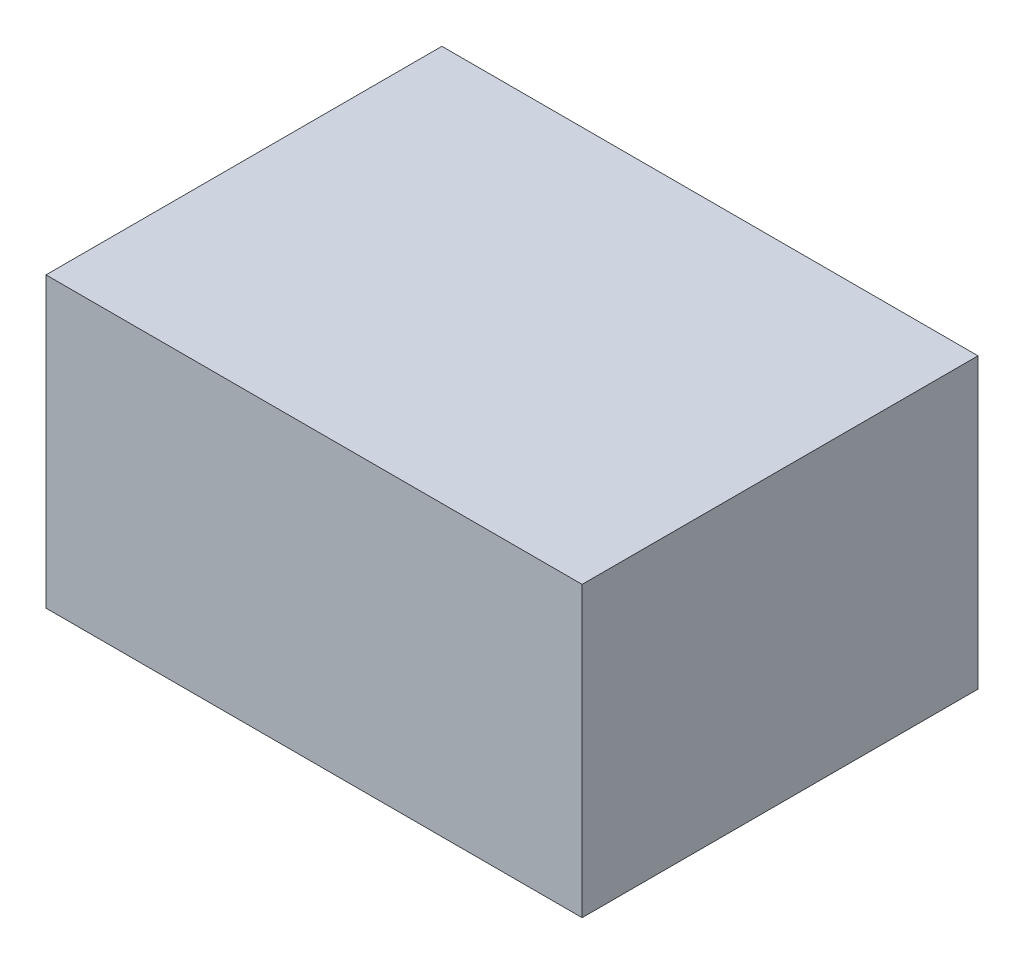
ISO-10303-21;
HEADER;
FILE_DESCRIPTION(('STEP AP214'),'2;1');
FILE_NAME('part.step','',(''),(''),'','','');
FILE_SCHEMA(('AUTOMOTIVE_DESIGN { 1 0 10303 214 1 1 1 1 }'));
ENDSEC;
DATA;
#1=APPLICATION_CONTEXT('core data for automotive mechanical design processes');
#2=APPLICATION_PROTOCOL_DEFINITION('international standard','automotive_design',2000,#1);
#3=PRODUCT_CONTEXT('',#1,'mechanical');
#4=PRODUCT('Part','Part','',(#3));
#5=PRODUCT_RELATED_PRODUCT_CATEGORY('part','',(#4));
#6=PRODUCT_DEFINITION_FORMATION('','',#4);
#7=PRODUCT_DEFINITION_CONTEXT('part definition',#1,'design');
#8=PRODUCT_DEFINITION('design','',#6,#7);
#9=PRODUCT_DEFINITION_SHAPE('','',#8);
#10=(LENGTH_UNIT() NAMED_UNIT(*) SI_UNIT(.MILLI.,.METRE.));
#11=(NAMED_UNIT(*) PLANE_ANGLE_UNIT() SI_UNIT($,.RADIAN.));
#12=(NAMED_UNIT(*) SI_UNIT($,.STERADIAN.) SOLID_ANGLE_UNIT());
#13=UNCERTAINTY_MEASURE_WITH_UNIT(LENGTH_MEASURE(1.E-05),#10,'distance_accuracy_value','');
#14=(GEOMETRIC_REPRESENTATION_CONTEXT(3) GLOBAL_UNCERTAINTY_ASSIGNED_CONTEXT((#13)) GLOBAL_UNIT_ASSIGNED_CONTEXT((#10,
#11,#12)) REPRESENTATION_CONTEXT('',''));
#15=CARTESIAN_POINT('',(0.,0.,0.));
#16=DIRECTION('',(0.,0.,1.));
#17=DIRECTION('',(1.,0.,0.));
#18=AXIS2_PLACEMENT_3D('',#15,#16,#17);
#19=CARTESIAN_POINT('',(-325.,175.,480.));
#20=DIRECTION('',(1.,0.,0.));
#21=DIRECTION('',(0.,1.,0.));
#22=AXIS2_PLACEMENT_3D('',#19,#20,#21);
#23=PLANE('',#22);
#24=DIRECTION('',(0.,-1.,0.));
#25=VECTOR('',#24,1.);
#26=CARTESIAN_POINT('',(-325.,175.,0.));
#27=LINE('',#26,#25);
#28=CARTESIAN_POINT('',(-325.,175.,0.));
#29=VERTEX_POINT('',#28);
#30=CARTESIAN_POINT('',(-325.,-175.,0.));
#31=VERTEX_POINT('',#30);
#32=EDGE_CURVE('E96',#29,#31,#27,.T.);
#33=ORIENTED_EDGE('',*,*,#32,.T.);
#34=DIRECTION('',(0.,0.,-1.));
#35=VECTOR('',#34,1.);
#36=CARTESIAN_POINT('',(-325.,-175.,480.));
#37=LINE('',#36,#35);
#38=CARTESIAN_POINT('',(-325.,-175.,480.));
#39=VERTEX_POINT('',#38);
#40=EDGE_CURVE('E11',#39,#31,#37,.T.);
#41=ORIENTED_EDGE('',*,*,#40,.F.);
#42=DIRECTION('',(0.,-1.,0.));
#43=VECTOR('',#42,1.);
#44=CARTESIAN_POINT('',(-325.,175.,480.));
#45=LINE('',#44,#43);
#46=CARTESIAN_POINT('',(-325.,175.,480.));
#47=VERTEX_POINT('',#46);
#48=EDGE_CURVE('E84',#47,#39,#45,.T.);
#49=ORIENTED_EDGE('',*,*,#48,.F.);
#50=DIRECTION('',(0.,0.,-1.));
#51=VECTOR('',#50,1.);
#52=CARTESIAN_POINT('',(-325.,175.,480.));
#53=LINE('',#52,#51);
#54=EDGE_CURVE('E92',#47,#29,#53,.T.);
#55=ORIENTED_EDGE('',*,*,#54,.T.);
#56=EDGE_LOOP('',(#33,#41,#49,#55));
#57=FACE_BOUND('',#56,.T.);
#58=ADVANCED_FACE('F33',(#57),#23,.F.);
#59=CARTESIAN_POINT('',(325.,-175.,480.));
#60=DIRECTION('',(0.,1.,0.));
#61=DIRECTION('',(-1.,0.,0.));
#62=AXIS2_PLACEMENT_3D('',#59,#60,#61);
#63=PLANE('',#62);
#64=DIRECTION('',(1.,0.,0.));
#65=VECTOR('',#64,1.);
#66=CARTESIAN_POINT('',(325.,-175.,0.));
#67=LINE('',#66,#65);
#68=CARTESIAN_POINT('',(325.,-175.,0.));
#69=VERTEX_POINT('',#68);
#70=EDGE_CURVE('E88',#31,#69,#67,.T.);
#71=ORIENTED_EDGE('',*,*,#70,.T.);
#72=DIRECTION('',(0.,0.,-1.));
#73=VECTOR('',#72,1.);
#74=CARTESIAN_POINT('',(325.,-175.,480.));
#75=LINE('',#74,#73);
#76=CARTESIAN_POINT('',(325.,-175.,480.));
#77=VERTEX_POINT('',#76);
#78=EDGE_CURVE('E41',#77,#69,#75,.T.);
#79=ORIENTED_EDGE('',*,*,#78,.F.);
#80=DIRECTION('',(1.,0.,0.));
#81=VECTOR('',#80,1.);
#82=CARTESIAN_POINT('',(325.,-175.,480.));
#83=LINE('',#82,#81);
#84=EDGE_CURVE('E79',#39,#77,#83,.T.);
#85=ORIENTED_EDGE('',*,*,#84,.F.);
#86=ORIENTED_EDGE('',*,*,#40,.T.);
#87=EDGE_LOOP('',(#71,#79,#85,#86));
#88=FACE_BOUND('',#87,.T.);
#89=ADVANCED_FACE('F87',(#88),#63,.F.);
#90=CARTESIAN_POINT('',(325.,175.,480.));
#91=DIRECTION('',(-1.,0.,0.));
#92=DIRECTION('',(0.,-1.,0.));
#93=AXIS2_PLACEMENT_3D('',#90,#91,#92);
#94=PLANE('',#93);
#95=DIRECTION('',(0.,1.,0.));
#96=VECTOR('',#95,1.);
#97=CARTESIAN_POINT('',(325.,175.,0.));
#98=LINE('',#97,#96);
#99=CARTESIAN_POINT('',(325.,175.,0.));
#100=VERTEX_POINT('',#99);
#101=EDGE_CURVE('E66',#69,#100,#98,.T.);
#102=ORIENTED_EDGE('',*,*,#101,.T.);
#103=DIRECTION('',(0.,0.,-1.));
#104=VECTOR('',#103,1.);
#105=CARTESIAN_POINT('',(325.,175.,480.));
#106=LINE('',#105,#104);
#107=CARTESIAN_POINT('',(325.,175.,480.));
#108=VERTEX_POINT('',#107);
#109=EDGE_CURVE('E89',#108,#100,#106,.T.);
#110=ORIENTED_EDGE('',*,*,#109,.F.);
#111=DIRECTION('',(0.,1.,0.));
#112=VECTOR('',#111,1.);
#113=CARTESIAN_POINT('',(325.,175.,480.));
#114=LINE('',#113,#112);
#115=EDGE_CURVE('E82',#77,#108,#114,.T.);
#116=ORIENTED_EDGE('',*,*,#115,.F.);
#117=ORIENTED_EDGE('',*,*,#78,.T.);
#118=EDGE_LOOP('',(#102,#110,#116,#117));
#119=FACE_BOUND('',#118,.T.);
#120=ADVANCED_FACE('F90',(#119),#94,.F.);
#121=CARTESIAN_POINT('',(325.,175.,480.));
#122=DIRECTION('',(0.,-1.,0.));
#123=DIRECTION('',(1.,0.,0.));
#124=AXIS2_PLACEMENT_3D('',#121,#122,#123);
#125=PLANE('',#124);
#126=DIRECTION('',(-1.,0.,0.));
#127=VECTOR('',#126,1.);
#128=CARTESIAN_POINT('',(325.,175.,0.));
#129=LINE('',#128,#127);
#130=EDGE_CURVE('E72',#100,#29,#129,.T.);
#131=ORIENTED_EDGE('',*,*,#130,.T.);
#132=ORIENTED_EDGE('',*,*,#54,.F.);
#133=DIRECTION('',(-1.,0.,0.));
#134=VECTOR('',#133,1.);
#135=CARTESIAN_POINT('',(325.,175.,480.));
#136=LINE('',#135,#134);
#137=EDGE_CURVE('E49',#108,#47,#136,.T.);
#138=ORIENTED_EDGE('',*,*,#137,.F.);
#139=ORIENTED_EDGE('',*,*,#109,.T.);
#140=EDGE_LOOP('',(#131,#132,#138,#139));
#141=FACE_BOUND('',#140,.T.);
#142=ADVANCED_FACE('F103',(#141),#125,.F.);
#143=CARTESIAN_POINT('',(0.,0.,480.));
#144=DIRECTION('',(0.,0.,-1.));
#145=DIRECTION('',(-1.,0.,0.));
#146=AXIS2_PLACEMENT_3D('',#143,#144,#145);
#147=PLANE('',#146);
#148=ORIENTED_EDGE('',*,*,#48,.T.);
#149=ORIENTED_EDGE('',*,*,#84,.T.);
#150=ORIENTED_EDGE('',*,*,#115,.T.);
#151=ORIENTED_EDGE('',*,*,#137,.T.);
#152=EDGE_LOOP('',(#148,#149,#150,#151));
#153=FACE_BOUND('',#152,.T.);
#154=ADVANCED_FACE('F80',(#153),#147,.F.);
#155=CARTESIAN_POINT('',(0.,0.,0.));
#156=DIRECTION('',(0.,0.,-1.));
#157=DIRECTION('',(-1.,0.,0.));
#158=AXIS2_PLACEMENT_3D('',#155,#156,#157);
#159=PLANE('',#158);
#160=ORIENTED_EDGE('',*,*,#32,.F.);
#161=ORIENTED_EDGE('',*,*,#130,.F.);
#162=ORIENTED_EDGE('',*,*,#101,.F.);
#163=ORIENTED_EDGE('',*,*,#70,.F.);
#164=EDGE_LOOP('',(#160,#161,#162,#163));
#165=FACE_BOUND('',#164,.T.);
#166=ADVANCED_FACE('F106',(#165),#159,.T.);
#167=CLOSED_SHELL('',(#58,#89,#120,#142,#154,#166));
#168=MANIFOLD_SOLID_BREP('B2',#167);
#169=ADVANCED_BREP_SHAPE_REPRESENTATION('',(#18,#168),#14);
#170=SHAPE_DEFINITION_REPRESENTATION(#9,#169);
ENDSEC;
END-ISO-10303-21;
